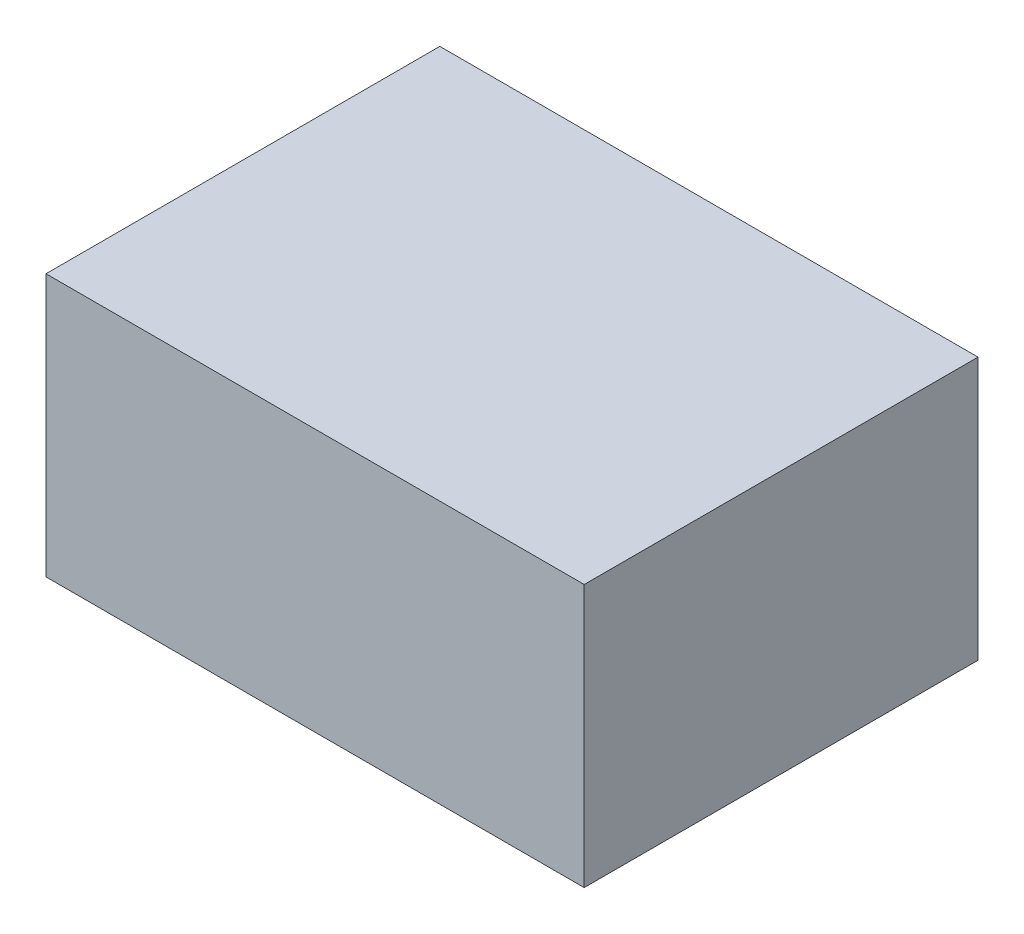
ISO-10303-21;
HEADER;
FILE_DESCRIPTION(('STEP AP214'),'2;1');
FILE_NAME('part.step','',(''),(''),'','','');
FILE_SCHEMA(('AUTOMOTIVE_DESIGN { 1 0 10303 214 1 1 1 1 }'));
ENDSEC;
DATA;
#1=APPLICATION_CONTEXT('core data for automotive mechanical design processes');
#2=APPLICATION_PROTOCOL_DEFINITION('international standard','automotive_design',2000,#1);
#3=PRODUCT_CONTEXT('',#1,'mechanical');
#4=PRODUCT('Part','Part','',(#3));
#5=PRODUCT_RELATED_PRODUCT_CATEGORY('part','',(#4));
#6=PRODUCT_DEFINITION_FORMATION('','',#4);
#7=PRODUCT_DEFINITION_CONTEXT('part definition',#1,'design');
#8=PRODUCT_DEFINITION('design','',#6,#7);
#9=PRODUCT_DEFINITION_SHAPE('','',#8);
#10=(LENGTH_UNIT() NAMED_UNIT(*) SI_UNIT(.MILLI.,.METRE.));
#11=(NAMED_UNIT(*) PLANE_ANGLE_UNIT() SI_UNIT($,.RADIAN.));
#12=(NAMED_UNIT(*) SI_UNIT($,.STERADIAN.) SOLID_ANGLE_UNIT());
#13=UNCERTAINTY_MEASURE_WITH_UNIT(LENGTH_MEASURE(1.E-05),#10,'distance_accuracy_value','');
#14=(GEOMETRIC_REPRESENTATION_CONTEXT(3) GLOBAL_UNCERTAINTY_ASSIGNED_CONTEXT((#13)) GLOBAL_UNIT_ASSIGNED_CONTEXT((#10,
#11,#12)) REPRESENTATION_CONTEXT('',''));
#15=CARTESIAN_POINT('',(0.,0.,0.));
#16=DIRECTION('',(0.,0.,1.));
#17=DIRECTION('',(1.,0.,0.));
#18=AXIS2_PLACEMENT_3D('',#15,#16,#17);
#19=CARTESIAN_POINT('',(20.5,-10.,30.));
#20=DIRECTION('',(-1.,0.,0.));
#21=DIRECTION('',(0.,0.,1.));
#22=AXIS2_PLACEMENT_3D('',#19,#20,#21);
#23=PLANE('',#22);
#24=DIRECTION('',(0.,1.,0.));
#25=VECTOR('',#24,1.);
#26=CARTESIAN_POINT('',(20.5,-10.,0.));
#27=LINE('',#26,#25);
#28=CARTESIAN_POINT('',(20.5,-10.,0.));
#29=VERTEX_POINT('',#28);
#30=CARTESIAN_POINT('',(20.5,10.,0.));
#31=VERTEX_POINT('',#30);
#32=EDGE_CURVE('E99',#29,#31,#27,.T.);
#33=ORIENTED_EDGE('',*,*,#32,.T.);
#34=DIRECTION('',(0.,0.,-1.));
#35=VECTOR('',#34,1.);
#36=CARTESIAN_POINT('',(20.5,10.,30.));
#37=LINE('',#36,#35);
#38=CARTESIAN_POINT('',(20.5,10.,30.));
#39=VERTEX_POINT('',#38);
#40=EDGE_CURVE('E11',#39,#31,#37,.T.);
#41=ORIENTED_EDGE('',*,*,#40,.F.);
#42=DIRECTION('',(0.,1.,0.));
#43=VECTOR('',#42,1.);
#44=CARTESIAN_POINT('',(20.5,-10.,30.));
#45=LINE('',#44,#43);
#46=CARTESIAN_POINT('',(20.5,-10.,30.));
#47=VERTEX_POINT('',#46);
#48=EDGE_CURVE('E87',#47,#39,#45,.T.);
#49=ORIENTED_EDGE('',*,*,#48,.F.);
#50=DIRECTION('',(0.,0.,-1.));
#51=VECTOR('',#50,1.);
#52=CARTESIAN_POINT('',(20.5,-10.,30.));
#53=LINE('',#52,#51);
#54=EDGE_CURVE('E95',#47,#29,#53,.T.);
#55=ORIENTED_EDGE('',*,*,#54,.T.);
#56=EDGE_LOOP('',(#33,#41,#49,#55));
#57=FACE_BOUND('',#56,.T.);
#58=ADVANCED_FACE('F36',(#57),#23,.F.);
#59=CARTESIAN_POINT('',(-20.5,10.,30.));
#60=DIRECTION('',(0.,-1.,0.));
#61=DIRECTION('',(0.,0.,-1.));
#62=AXIS2_PLACEMENT_3D('',#59,#60,#61);
#63=PLANE('',#62);
#64=DIRECTION('',(-1.,0.,0.));
#65=VECTOR('',#64,1.);
#66=CARTESIAN_POINT('',(-20.5,10.,0.));
#67=LINE('',#66,#65);
#68=CARTESIAN_POINT('',(-20.5,10.,0.));
#69=VERTEX_POINT('',#68);
#70=EDGE_CURVE('E91',#31,#69,#67,.T.);
#71=ORIENTED_EDGE('',*,*,#70,.T.);
#72=DIRECTION('',(0.,0.,-1.));
#73=VECTOR('',#72,1.);
#74=CARTESIAN_POINT('',(-20.5,10.,30.));
#75=LINE('',#74,#73);
#76=CARTESIAN_POINT('',(-20.5,10.,30.));
#77=VERTEX_POINT('',#76);
#78=EDGE_CURVE('E44',#77,#69,#75,.T.);
#79=ORIENTED_EDGE('',*,*,#78,.F.);
#80=DIRECTION('',(-1.,0.,0.));
#81=VECTOR('',#80,1.);
#82=CARTESIAN_POINT('',(-20.5,10.,30.));
#83=LINE('',#82,#81);
#84=EDGE_CURVE('E82',#39,#77,#83,.T.);
#85=ORIENTED_EDGE('',*,*,#84,.F.);
#86=ORIENTED_EDGE('',*,*,#40,.T.);
#87=EDGE_LOOP('',(#71,#79,#85,#86));
#88=FACE_BOUND('',#87,.T.);
#89=ADVANCED_FACE('F90',(#88),#63,.F.);
#90=CARTESIAN_POINT('',(-20.5,-10.,30.));
#91=DIRECTION('',(1.,0.,0.));
#92=DIRECTION('',(0.,0.,-1.));
#93=AXIS2_PLACEMENT_3D('',#90,#91,#92);
#94=PLANE('',#93);
#95=DIRECTION('',(0.,-1.,0.));
#96=VECTOR('',#95,1.);
#97=CARTESIAN_POINT('',(-20.5,-10.,0.));
#98=LINE('',#97,#96);
#99=CARTESIAN_POINT('',(-20.5,-10.,0.));
#100=VERTEX_POINT('',#99);
#101=EDGE_CURVE('E69',#69,#100,#98,.T.);
#102=ORIENTED_EDGE('',*,*,#101,.T.);
#103=DIRECTION('',(0.,0.,-1.));
#104=VECTOR('',#103,1.);
#105=CARTESIAN_POINT('',(-20.5,-10.,30.));
#106=LINE('',#105,#104);
#107=CARTESIAN_POINT('',(-20.5,-10.,30.));
#108=VERTEX_POINT('',#107);
#109=EDGE_CURVE('E92',#108,#100,#106,.T.);
#110=ORIENTED_EDGE('',*,*,#109,.F.);
#111=DIRECTION('',(0.,-1.,0.));
#112=VECTOR('',#111,1.);
#113=CARTESIAN_POINT('',(-20.5,-10.,30.));
#114=LINE('',#113,#112);
#115=EDGE_CURVE('E85',#77,#108,#114,.T.);
#116=ORIENTED_EDGE('',*,*,#115,.F.);
#117=ORIENTED_EDGE('',*,*,#78,.T.);
#118=EDGE_LOOP('',(#102,#110,#116,#117));
#119=FACE_BOUND('',#118,.T.);
#120=ADVANCED_FACE('F93',(#119),#94,.F.);
#121=CARTESIAN_POINT('',(-20.5,-10.,30.));
#122=DIRECTION('',(0.,1.,0.));
#123=DIRECTION('',(0.,0.,1.));
#124=AXIS2_PLACEMENT_3D('',#121,#122,#123);
#125=PLANE('',#124);
#126=DIRECTION('',(1.,0.,0.));
#127=VECTOR('',#126,1.);
#128=CARTESIAN_POINT('',(-20.5,-10.,0.));
#129=LINE('',#128,#127);
#130=EDGE_CURVE('E75',#100,#29,#129,.T.);
#131=ORIENTED_EDGE('',*,*,#130,.T.);
#132=ORIENTED_EDGE('',*,*,#54,.F.);
#133=DIRECTION('',(1.,0.,0.));
#134=VECTOR('',#133,1.);
#135=CARTESIAN_POINT('',(-20.5,-10.,30.));
#136=LINE('',#135,#134);
#137=EDGE_CURVE('E52',#108,#47,#136,.T.);
#138=ORIENTED_EDGE('',*,*,#137,.F.);
#139=ORIENTED_EDGE('',*,*,#109,.T.);
#140=EDGE_LOOP('',(#131,#132,#138,#139));
#141=FACE_BOUND('',#140,.T.);
#142=ADVANCED_FACE('F106',(#141),#125,.F.);
#143=CARTESIAN_POINT('',(0.,0.,30.));
#144=DIRECTION('',(0.,0.,-1.));
#145=DIRECTION('',(-1.,0.,0.));
#146=AXIS2_PLACEMENT_3D('',#143,#144,#145);
#147=PLANE('',#146);
#148=ORIENTED_EDGE('',*,*,#48,.T.);
#149=ORIENTED_EDGE('',*,*,#84,.T.);
#150=ORIENTED_EDGE('',*,*,#115,.T.);
#151=ORIENTED_EDGE('',*,*,#137,.T.);
#152=EDGE_LOOP('',(#148,#149,#150,#151));
#153=FACE_BOUND('',#152,.T.);
#154=ADVANCED_FACE('F83',(#153),#147,.F.);
#155=CARTESIAN_POINT('',(0.,0.,0.));
#156=DIRECTION('',(0.,0.,-1.));
#157=DIRECTION('',(-1.,0.,0.));
#158=AXIS2_PLACEMENT_3D('',#155,#156,#157);
#159=PLANE('',#158);
#160=ORIENTED_EDGE('',*,*,#32,.F.);
#161=ORIENTED_EDGE('',*,*,#130,.F.);
#162=ORIENTED_EDGE('',*,*,#101,.F.);
#163=ORIENTED_EDGE('',*,*,#70,.F.);
#164=EDGE_LOOP('',(#160,#161,#162,#163));
#165=FACE_BOUND('',#164,.T.);
#166=ADVANCED_FACE('F109',(#165),#159,.T.);
#167=CLOSED_SHELL('',(#58,#89,#120,#142,#154,#166));
#168=MANIFOLD_SOLID_BREP('B2',#167);
#169=ADVANCED_BREP_SHAPE_REPRESENTATION('',(#18,#168),#14);
#170=SHAPE_DEFINITION_REPRESENTATION(#9,#169);
ENDSEC;
END-ISO-10303-21;
